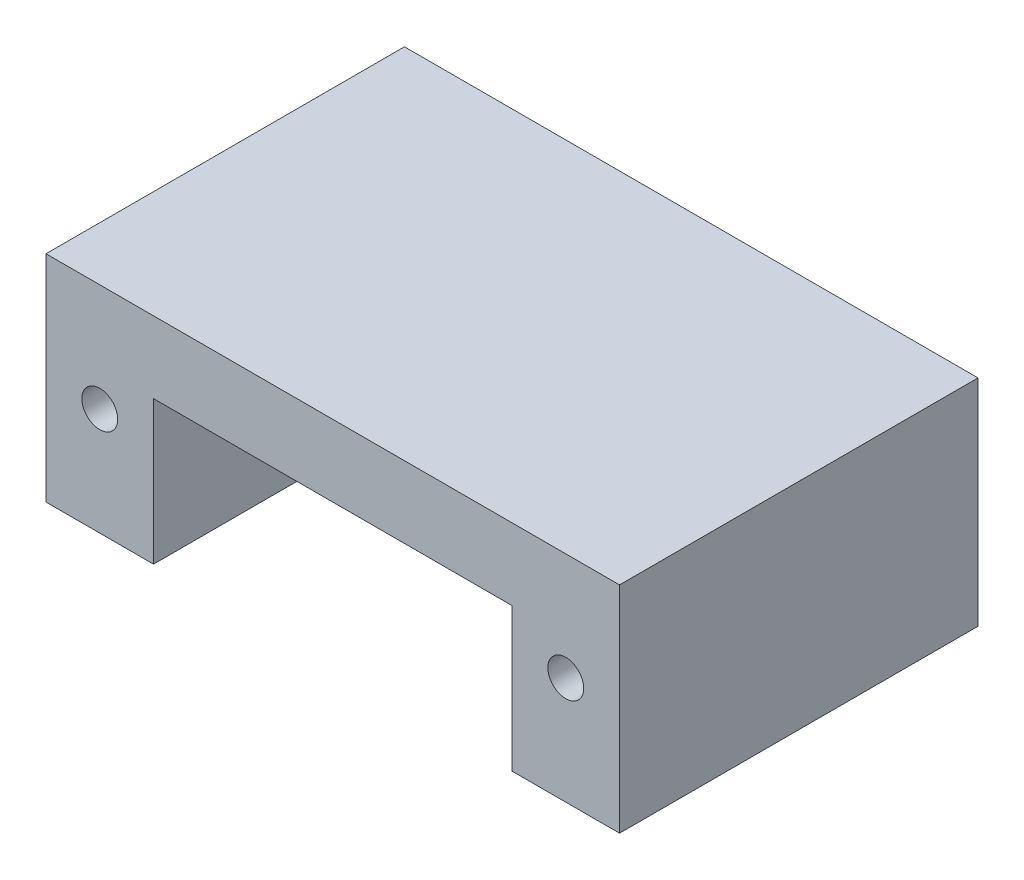
ISO-10303-21;
HEADER;
FILE_DESCRIPTION(('STEP AP214'),'2;1');
FILE_NAME('part.step','',(''),(''),'','','');
FILE_SCHEMA(('AUTOMOTIVE_DESIGN { 1 0 10303 214 1 1 1 1 }'));
ENDSEC;
DATA;
#1=APPLICATION_CONTEXT('core data for automotive mechanical design processes');
#2=APPLICATION_PROTOCOL_DEFINITION('international standard','automotive_design',2000,#1);
#3=PRODUCT_CONTEXT('',#1,'mechanical');
#4=PRODUCT('Part','Part','',(#3));
#5=PRODUCT_RELATED_PRODUCT_CATEGORY('part','',(#4));
#6=PRODUCT_DEFINITION_FORMATION('','',#4);
#7=PRODUCT_DEFINITION_CONTEXT('part definition',#1,'design');
#8=PRODUCT_DEFINITION('design','',#6,#7);
#9=PRODUCT_DEFINITION_SHAPE('','',#8);
#10=(LENGTH_UNIT() NAMED_UNIT(*) SI_UNIT(.MILLI.,.METRE.));
#11=(NAMED_UNIT(*) PLANE_ANGLE_UNIT() SI_UNIT($,.RADIAN.));
#12=(NAMED_UNIT(*) SI_UNIT($,.STERADIAN.) SOLID_ANGLE_UNIT());
#13=UNCERTAINTY_MEASURE_WITH_UNIT(LENGTH_MEASURE(1.E-05),#10,'distance_accuracy_value','');
#14=(GEOMETRIC_REPRESENTATION_CONTEXT(3) GLOBAL_UNCERTAINTY_ASSIGNED_CONTEXT((#13)) GLOBAL_UNIT_ASSIGNED_CONTEXT((#10,
#11,#12)) REPRESENTATION_CONTEXT('',''));
#15=CARTESIAN_POINT('',(0.,0.,0.));
#16=DIRECTION('',(0.,0.,1.));
#17=DIRECTION('',(1.,0.,0.));
#18=AXIS2_PLACEMENT_3D('',#15,#16,#17);
#19=CARTESIAN_POINT('',(-40.,-15.,50.));
#20=DIRECTION('',(0.,1.,0.));
#21=DIRECTION('',(0.,0.,1.));
#22=AXIS2_PLACEMENT_3D('',#19,#20,#21);
#23=PLANE('',#22);
#24=DIRECTION('',(1.,0.,0.));
#25=VECTOR('',#24,1.);
#26=CARTESIAN_POINT('',(-40.,-15.,0.));
#27=LINE('',#26,#25);
#28=CARTESIAN_POINT('',(-40.,-15.,0.));
#29=VERTEX_POINT('',#28);
#30=CARTESIAN_POINT('',(-25.,-15.,0.));
#31=VERTEX_POINT('',#30);
#32=EDGE_CURVE('E135',#29,#31,#27,.T.);
#33=ORIENTED_EDGE('',*,*,#32,.T.);
#34=DIRECTION('',(0.,0.,1.));
#35=VECTOR('',#34,1.);
#36=CARTESIAN_POINT('',(-25.,-15.,0.));
#37=LINE('',#36,#35);
#38=CARTESIAN_POINT('',(-25.,-15.,50.));
#39=VERTEX_POINT('',#38);
#40=EDGE_CURVE('E167',#31,#39,#37,.T.);
#41=ORIENTED_EDGE('',*,*,#40,.T.);
#42=DIRECTION('',(1.,0.,0.));
#43=VECTOR('',#42,1.);
#44=CARTESIAN_POINT('',(-40.,-15.,50.));
#45=LINE('',#44,#43);
#46=CARTESIAN_POINT('',(-40.,-15.,50.));
#47=VERTEX_POINT('',#46);
#48=EDGE_CURVE('E150',#47,#39,#45,.T.);
#49=ORIENTED_EDGE('',*,*,#48,.F.);
#50=DIRECTION('',(0.,0.,-1.));
#51=VECTOR('',#50,1.);
#52=CARTESIAN_POINT('',(-40.,-15.,50.));
#53=LINE('',#52,#51);
#54=EDGE_CURVE('E149',#47,#29,#53,.T.);
#55=ORIENTED_EDGE('',*,*,#54,.T.);
#56=EDGE_LOOP('',(#33,#41,#49,#55));
#57=FACE_BOUND('',#56,.T.);
#58=ADVANCED_FACE('F42',(#57),#23,.F.);
#59=CARTESIAN_POINT('',(40.,15.,50.));
#60=DIRECTION('',(-1.,0.,0.));
#61=DIRECTION('',(0.,0.,1.));
#62=AXIS2_PLACEMENT_3D('',#59,#60,#61);
#63=PLANE('',#62);
#64=DIRECTION('',(0.,1.,0.));
#65=VECTOR('',#64,1.);
#66=CARTESIAN_POINT('',(40.,15.,0.));
#67=LINE('',#66,#65);
#68=CARTESIAN_POINT('',(40.,-15.,0.));
#69=VERTEX_POINT('',#68);
#70=CARTESIAN_POINT('',(40.,15.,0.));
#71=VERTEX_POINT('',#70);
#72=EDGE_CURVE('E133',#69,#71,#67,.T.);
#73=ORIENTED_EDGE('',*,*,#72,.T.);
#74=DIRECTION('',(0.,0.,-1.));
#75=VECTOR('',#74,1.);
#76=CARTESIAN_POINT('',(40.,15.,50.));
#77=LINE('',#76,#75);
#78=CARTESIAN_POINT('',(40.,15.,50.));
#79=VERTEX_POINT('',#78);
#80=EDGE_CURVE('E11',#79,#71,#77,.T.);
#81=ORIENTED_EDGE('',*,*,#80,.F.);
#82=DIRECTION('',(0.,1.,0.));
#83=VECTOR('',#82,1.);
#84=CARTESIAN_POINT('',(40.,15.,50.));
#85=LINE('',#84,#83);
#86=CARTESIAN_POINT('',(40.,-15.,50.));
#87=VERTEX_POINT('',#86);
#88=EDGE_CURVE('E141',#87,#79,#85,.T.);
#89=ORIENTED_EDGE('',*,*,#88,.F.);
#90=DIRECTION('',(0.,0.,-1.));
#91=VECTOR('',#90,1.);
#92=CARTESIAN_POINT('',(40.,-15.,50.));
#93=LINE('',#92,#91);
#94=EDGE_CURVE('E146',#87,#69,#93,.T.);
#95=ORIENTED_EDGE('',*,*,#94,.T.);
#96=EDGE_LOOP('',(#73,#81,#89,#95));
#97=FACE_BOUND('',#96,.T.);
#98=ADVANCED_FACE('F44',(#97),#63,.F.);
#99=CARTESIAN_POINT('',(-40.,15.,50.));
#100=DIRECTION('',(0.,-1.,0.));
#101=DIRECTION('',(0.,0.,-1.));
#102=AXIS2_PLACEMENT_3D('',#99,#100,#101);
#103=PLANE('',#102);
#104=DIRECTION('',(-1.,0.,0.));
#105=VECTOR('',#104,1.);
#106=CARTESIAN_POINT('',(-40.,15.,0.));
#107=LINE('',#106,#105);
#108=CARTESIAN_POINT('',(-40.,15.,0.));
#109=VERTEX_POINT('',#108);
#110=EDGE_CURVE('E142',#71,#109,#107,.T.);
#111=ORIENTED_EDGE('',*,*,#110,.T.);
#112=DIRECTION('',(0.,0.,-1.));
#113=VECTOR('',#112,1.);
#114=CARTESIAN_POINT('',(-40.,15.,50.));
#115=LINE('',#114,#113);
#116=CARTESIAN_POINT('',(-40.,15.,50.));
#117=VERTEX_POINT('',#116);
#118=EDGE_CURVE('E51',#117,#109,#115,.T.);
#119=ORIENTED_EDGE('',*,*,#118,.F.);
#120=DIRECTION('',(-1.,0.,0.));
#121=VECTOR('',#120,1.);
#122=CARTESIAN_POINT('',(-40.,15.,50.));
#123=LINE('',#122,#121);
#124=EDGE_CURVE('E96',#79,#117,#123,.T.);
#125=ORIENTED_EDGE('',*,*,#124,.F.);
#126=ORIENTED_EDGE('',*,*,#80,.T.);
#127=EDGE_LOOP('',(#111,#119,#125,#126));
#128=FACE_BOUND('',#127,.T.);
#129=ADVANCED_FACE('F178',(#128),#103,.F.);
#130=CARTESIAN_POINT('',(-40.,15.,50.));
#131=DIRECTION('',(1.,0.,0.));
#132=DIRECTION('',(0.,1.,0.));
#133=AXIS2_PLACEMENT_3D('',#130,#131,#132);
#134=PLANE('',#133);
#135=DIRECTION('',(0.,-1.,0.));
#136=VECTOR('',#135,1.);
#137=CARTESIAN_POINT('',(-40.,15.,0.));
#138=LINE('',#137,#136);
#139=EDGE_CURVE('E136',#109,#29,#138,.T.);
#140=ORIENTED_EDGE('',*,*,#139,.T.);
#141=ORIENTED_EDGE('',*,*,#54,.F.);
#142=DIRECTION('',(0.,-1.,0.));
#143=VECTOR('',#142,1.);
#144=CARTESIAN_POINT('',(-40.,15.,50.));
#145=LINE('',#144,#143);
#146=EDGE_CURVE('E160',#117,#47,#145,.T.);
#147=ORIENTED_EDGE('',*,*,#146,.F.);
#148=ORIENTED_EDGE('',*,*,#118,.T.);
#149=EDGE_LOOP('',(#140,#141,#147,#148));
#150=FACE_BOUND('',#149,.T.);
#151=ADVANCED_FACE('F158',(#150),#134,.F.);
#152=CARTESIAN_POINT('',(25.,-15.,50.));
#153=VERTEX_POINT('',#152);
#154=EDGE_CURVE('E67',#153,#87,#45,.T.);
#155=ORIENTED_EDGE('',*,*,#154,.F.);
#156=DIRECTION('',(0.,0.,1.));
#157=VECTOR('',#156,1.);
#158=CARTESIAN_POINT('',(25.,-15.,0.));
#159=LINE('',#158,#157);
#160=CARTESIAN_POINT('',(25.,-15.,0.));
#161=VERTEX_POINT('',#160);
#162=EDGE_CURVE('E120',#161,#153,#159,.T.);
#163=ORIENTED_EDGE('',*,*,#162,.F.);
#164=EDGE_CURVE('E89',#161,#69,#27,.T.);
#165=ORIENTED_EDGE('',*,*,#164,.T.);
#166=ORIENTED_EDGE('',*,*,#94,.F.);
#167=EDGE_LOOP('',(#155,#163,#165,#166));
#168=FACE_BOUND('',#167,.T.);
#169=ADVANCED_FACE('F126',(#168),#23,.F.);
#170=CARTESIAN_POINT('',(0.,0.,50.));
#171=DIRECTION('',(0.,0.,1.));
#172=DIRECTION('',(1.,0.,0.));
#173=AXIS2_PLACEMENT_3D('',#170,#171,#172);
#174=PLANE('',#173);
#175=CARTESIAN_POINT('',(-32.5,0.,50.));
#176=DIRECTION('',(0.,0.,1.));
#177=DIRECTION('',(1.,0.,0.));
#178=AXIS2_PLACEMENT_3D('',#175,#176,#177);
#179=CIRCLE('',#178,2.5);
#180=CARTESIAN_POINT('',(-30.,0.,50.));
#181=VERTEX_POINT('',#180);
#182=EDGE_CURVE('E215',#181,#181,#179,.T.);
#183=ORIENTED_EDGE('',*,*,#182,.F.);
#184=EDGE_LOOP('',(#183));
#185=FACE_BOUND('',#184,.T.);
#186=CARTESIAN_POINT('',(32.5,0.,50.));
#187=DIRECTION('',(0.,0.,1.));
#188=DIRECTION('',(1.,0.,0.));
#189=AXIS2_PLACEMENT_3D('',#186,#187,#188);
#190=CIRCLE('',#189,2.5);
#191=CARTESIAN_POINT('',(35.,0.,50.));
#192=VERTEX_POINT('',#191);
#193=EDGE_CURVE('E211',#192,#192,#190,.T.);
#194=ORIENTED_EDGE('',*,*,#193,.F.);
#195=EDGE_LOOP('',(#194));
#196=FACE_BOUND('',#195,.T.);
#197=DIRECTION('',(0.,-1.,0.));
#198=VECTOR('',#197,1.);
#199=CARTESIAN_POINT('',(-25.,-15.,50.));
#200=LINE('',#199,#198);
#201=CARTESIAN_POINT('',(-25.,5.,50.));
#202=VERTEX_POINT('',#201);
#203=EDGE_CURVE('E124',#202,#39,#200,.T.);
#204=ORIENTED_EDGE('',*,*,#203,.F.);
#205=DIRECTION('',(-1.,0.,0.));
#206=VECTOR('',#205,1.);
#207=CARTESIAN_POINT('',(-25.,5.,50.));
#208=LINE('',#207,#206);
#209=CARTESIAN_POINT('',(25.,5.,50.));
#210=VERTEX_POINT('',#209);
#211=EDGE_CURVE('E195',#210,#202,#208,.T.);
#212=ORIENTED_EDGE('',*,*,#211,.F.);
#213=DIRECTION('',(0.,1.,0.));
#214=VECTOR('',#213,1.);
#215=CARTESIAN_POINT('',(25.,5.,50.));
#216=LINE('',#215,#214);
#217=EDGE_CURVE('E199',#153,#210,#216,.T.);
#218=ORIENTED_EDGE('',*,*,#217,.F.);
#219=ORIENTED_EDGE('',*,*,#154,.T.);
#220=ORIENTED_EDGE('',*,*,#88,.T.);
#221=ORIENTED_EDGE('',*,*,#124,.T.);
#222=ORIENTED_EDGE('',*,*,#146,.T.);
#223=ORIENTED_EDGE('',*,*,#48,.T.);
#224=EDGE_LOOP('',(#204,#212,#218,#219,#220,#221,#222,#223));
#225=FACE_BOUND('',#224,.T.);
#226=ADVANCED_FACE('F232',(#185,#196,#225),#174,.T.);
#227=CARTESIAN_POINT('',(0.,0.,0.));
#228=DIRECTION('',(0.,0.,1.));
#229=DIRECTION('',(1.,0.,0.));
#230=AXIS2_PLACEMENT_3D('',#227,#228,#229);
#231=PLANE('',#230);
#232=CARTESIAN_POINT('',(-32.5,0.,0.));
#233=DIRECTION('',(0.,0.,1.));
#234=DIRECTION('',(1.,0.,0.));
#235=AXIS2_PLACEMENT_3D('',#232,#233,#234);
#236=CIRCLE('',#235,2.5);
#237=CARTESIAN_POINT('',(-30.,0.,0.));
#238=VERTEX_POINT('',#237);
#239=EDGE_CURVE('E202',#238,#238,#236,.T.);
#240=ORIENTED_EDGE('',*,*,#239,.T.);
#241=EDGE_LOOP('',(#240));
#242=FACE_BOUND('',#241,.T.);
#243=CARTESIAN_POINT('',(32.5,0.,0.));
#244=DIRECTION('',(0.,0.,1.));
#245=DIRECTION('',(1.,0.,0.));
#246=AXIS2_PLACEMENT_3D('',#243,#244,#245);
#247=CIRCLE('',#246,2.5);
#248=CARTESIAN_POINT('',(35.,0.,0.));
#249=VERTEX_POINT('',#248);
#250=EDGE_CURVE('E207',#249,#249,#247,.T.);
#251=ORIENTED_EDGE('',*,*,#250,.T.);
#252=EDGE_LOOP('',(#251));
#253=FACE_BOUND('',#252,.T.);
#254=DIRECTION('',(-1.,0.,0.));
#255=VECTOR('',#254,1.);
#256=CARTESIAN_POINT('',(-25.,5.,0.));
#257=LINE('',#256,#255);
#258=CARTESIAN_POINT('',(25.,5.,0.));
#259=VERTEX_POINT('',#258);
#260=CARTESIAN_POINT('',(-25.,5.,0.));
#261=VERTEX_POINT('',#260);
#262=EDGE_CURVE('E58',#259,#261,#257,.T.);
#263=ORIENTED_EDGE('',*,*,#262,.T.);
#264=DIRECTION('',(0.,-1.,0.));
#265=VECTOR('',#264,1.);
#266=CARTESIAN_POINT('',(-25.,-15.,0.));
#267=LINE('',#266,#265);
#268=EDGE_CURVE('E128',#261,#31,#267,.T.);
#269=ORIENTED_EDGE('',*,*,#268,.T.);
#270=ORIENTED_EDGE('',*,*,#32,.F.);
#271=ORIENTED_EDGE('',*,*,#139,.F.);
#272=ORIENTED_EDGE('',*,*,#110,.F.);
#273=ORIENTED_EDGE('',*,*,#72,.F.);
#274=ORIENTED_EDGE('',*,*,#164,.F.);
#275=DIRECTION('',(0.,1.,0.));
#276=VECTOR('',#275,1.);
#277=CARTESIAN_POINT('',(25.,5.,0.));
#278=LINE('',#277,#276);
#279=EDGE_CURVE('E117',#161,#259,#278,.T.);
#280=ORIENTED_EDGE('',*,*,#279,.T.);
#281=EDGE_LOOP('',(#263,#269,#270,#271,#272,#273,#274,#280));
#282=FACE_BOUND('',#281,.T.);
#283=ADVANCED_FACE('F131',(#242,#253,#282),#231,.F.);
#284=CARTESIAN_POINT('',(-25.,-15.,0.));
#285=DIRECTION('',(-1.,0.,0.));
#286=DIRECTION('',(0.,0.,1.));
#287=AXIS2_PLACEMENT_3D('',#284,#285,#286);
#288=PLANE('',#287);
#289=ORIENTED_EDGE('',*,*,#203,.T.);
#290=ORIENTED_EDGE('',*,*,#40,.F.);
#291=ORIENTED_EDGE('',*,*,#268,.F.);
#292=DIRECTION('',(0.,0.,1.));
#293=VECTOR('',#292,1.);
#294=CARTESIAN_POINT('',(-25.,5.,0.));
#295=LINE('',#294,#293);
#296=EDGE_CURVE('E188',#261,#202,#295,.T.);
#297=ORIENTED_EDGE('',*,*,#296,.T.);
#298=EDGE_LOOP('',(#289,#290,#291,#297));
#299=FACE_BOUND('',#298,.T.);
#300=ADVANCED_FACE('F239',(#299),#288,.F.);
#301=CARTESIAN_POINT('',(-25.,5.,0.));
#302=DIRECTION('',(0.,1.,0.));
#303=DIRECTION('',(0.,0.,1.));
#304=AXIS2_PLACEMENT_3D('',#301,#302,#303);
#305=PLANE('',#304);
#306=ORIENTED_EDGE('',*,*,#211,.T.);
#307=ORIENTED_EDGE('',*,*,#296,.F.);
#308=ORIENTED_EDGE('',*,*,#262,.F.);
#309=DIRECTION('',(0.,0.,1.));
#310=VECTOR('',#309,1.);
#311=CARTESIAN_POINT('',(25.,5.,0.));
#312=LINE('',#311,#310);
#313=EDGE_CURVE('E121',#259,#210,#312,.T.);
#314=ORIENTED_EDGE('',*,*,#313,.T.);
#315=EDGE_LOOP('',(#306,#307,#308,#314));
#316=FACE_BOUND('',#315,.T.);
#317=ADVANCED_FACE('F240',(#316),#305,.F.);
#318=CARTESIAN_POINT('',(25.,5.,0.));
#319=DIRECTION('',(1.,0.,0.));
#320=DIRECTION('',(0.,0.,-1.));
#321=AXIS2_PLACEMENT_3D('',#318,#319,#320);
#322=PLANE('',#321);
#323=ORIENTED_EDGE('',*,*,#217,.T.);
#324=ORIENTED_EDGE('',*,*,#313,.F.);
#325=ORIENTED_EDGE('',*,*,#279,.F.);
#326=ORIENTED_EDGE('',*,*,#162,.T.);
#327=EDGE_LOOP('',(#323,#324,#325,#326));
#328=FACE_BOUND('',#327,.T.);
#329=ADVANCED_FACE('F119',(#328),#322,.F.);
#330=CARTESIAN_POINT('',(32.5,0.,0.));
#331=DIRECTION('',(0.,0.,1.));
#332=DIRECTION('',(1.,0.,0.));
#333=AXIS2_PLACEMENT_3D('',#330,#331,#332);
#334=CYLINDRICAL_SURFACE('',#333,2.5);
#335=ORIENTED_EDGE('',*,*,#250,.F.);
#336=EDGE_LOOP('',(#335));
#337=FACE_BOUND('',#336,.T.);
#338=ORIENTED_EDGE('',*,*,#193,.T.);
#339=EDGE_LOOP('',(#338));
#340=FACE_BOUND('',#339,.T.);
#341=ADVANCED_FACE('F228',(#337,#340),#334,.F.);
#342=CARTESIAN_POINT('',(-32.5,0.,0.));
#343=DIRECTION('',(0.,0.,1.));
#344=DIRECTION('',(1.,0.,0.));
#345=AXIS2_PLACEMENT_3D('',#342,#343,#344);
#346=CYLINDRICAL_SURFACE('',#345,2.5);
#347=ORIENTED_EDGE('',*,*,#239,.F.);
#348=EDGE_LOOP('',(#347));
#349=FACE_BOUND('',#348,.T.);
#350=ORIENTED_EDGE('',*,*,#182,.T.);
#351=EDGE_LOOP('',(#350));
#352=FACE_BOUND('',#351,.T.);
#353=ADVANCED_FACE('F225',(#349,#352),#346,.F.);
#354=CLOSED_SHELL('',(#58,#98,#129,#151,#169,#226,#283,#300,#317,#329,#341,#353));
#355=MANIFOLD_SOLID_BREP('B2',#354);
#356=ADVANCED_BREP_SHAPE_REPRESENTATION('',(#18,#355),#14);
#357=SHAPE_DEFINITION_REPRESENTATION(#9,#356);
ENDSEC;
END-ISO-10303-21;
